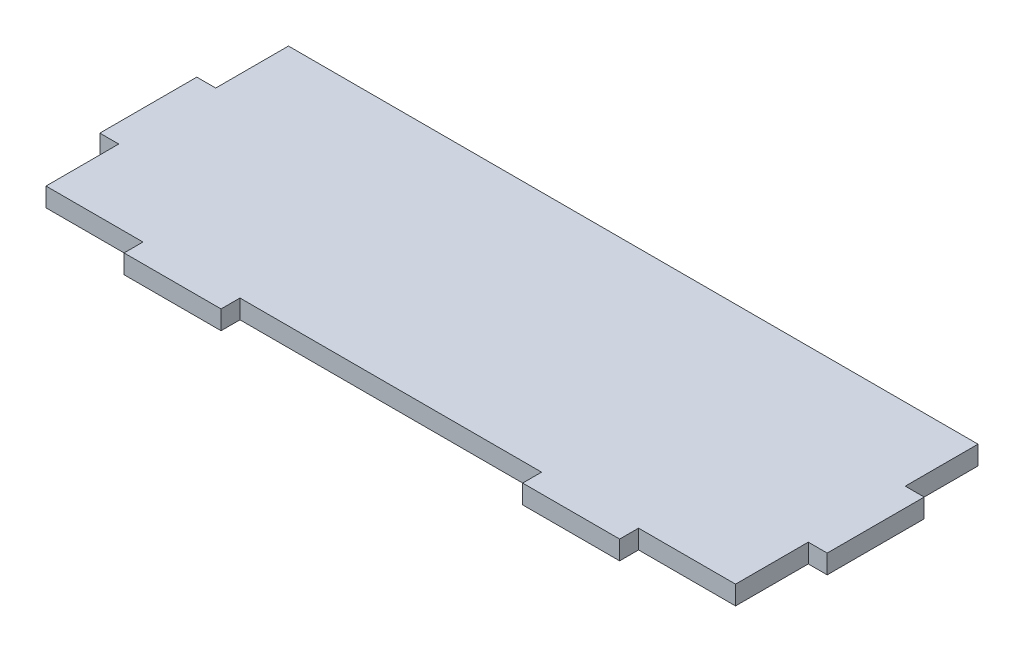
ISO-10303-21;
HEADER;
FILE_DESCRIPTION(('STEP AP214'),'2;1');
FILE_NAME('part.step','',(''),(''),'','','');
FILE_SCHEMA(('AUTOMOTIVE_DESIGN { 1 0 10303 214 1 1 1 1 }'));
ENDSEC;
DATA;
#1=APPLICATION_CONTEXT('core data for automotive mechanical design processes');
#2=APPLICATION_PROTOCOL_DEFINITION('international standard','automotive_design',2000,#1);
#3=PRODUCT_CONTEXT('',#1,'mechanical');
#4=PRODUCT('Part','Part','',(#3));
#5=PRODUCT_RELATED_PRODUCT_CATEGORY('part','',(#4));
#6=PRODUCT_DEFINITION_FORMATION('','',#4);
#7=PRODUCT_DEFINITION_CONTEXT('part definition',#1,'design');
#8=PRODUCT_DEFINITION('design','',#6,#7);
#9=PRODUCT_DEFINITION_SHAPE('','',#8);
#10=(LENGTH_UNIT() NAMED_UNIT(*) SI_UNIT(.MILLI.,.METRE.));
#11=(NAMED_UNIT(*) PLANE_ANGLE_UNIT() SI_UNIT($,.RADIAN.));
#12=(NAMED_UNIT(*) SI_UNIT($,.STERADIAN.) SOLID_ANGLE_UNIT());
#13=UNCERTAINTY_MEASURE_WITH_UNIT(LENGTH_MEASURE(1.E-05),#10,'distance_accuracy_value','');
#14=(GEOMETRIC_REPRESENTATION_CONTEXT(3) GLOBAL_UNCERTAINTY_ASSIGNED_CONTEXT((#13)) GLOBAL_UNIT_ASSIGNED_CONTEXT((#10,
#11,#12)) REPRESENTATION_CONTEXT('',''));
#15=CARTESIAN_POINT('',(0.,0.,0.));
#16=DIRECTION('',(0.,0.,1.));
#17=DIRECTION('',(1.,0.,0.));
#18=AXIS2_PLACEMENT_3D('',#15,#16,#17);
#19=CARTESIAN_POINT('',(51.1,3.9,25.));
#20=DIRECTION('',(0.,0.,-1.));
#21=DIRECTION('',(-1.,0.,0.));
#22=AXIS2_PLACEMENT_3D('',#19,#20,#21);
#23=PLANE('',#22);
#24=DIRECTION('',(1.,0.,0.));
#25=VECTOR('',#24,1.);
#26=CARTESIAN_POINT('',(51.1,0.,25.));
#27=LINE('',#26,#25);
#28=CARTESIAN_POINT('',(51.1,0.,25.));
#29=VERTEX_POINT('',#28);
#30=CARTESIAN_POINT('',(71.1,0.,25.));
#31=VERTEX_POINT('',#30);
#32=EDGE_CURVE('E214',#29,#31,#27,.T.);
#33=ORIENTED_EDGE('',*,*,#32,.T.);
#34=DIRECTION('',(0.,-1.,0.));
#35=VECTOR('',#34,1.);
#36=CARTESIAN_POINT('',(71.1,3.9,25.));
#37=LINE('',#36,#35);
#38=CARTESIAN_POINT('',(71.1,3.9,25.));
#39=VERTEX_POINT('',#38);
#40=EDGE_CURVE('E11',#39,#31,#37,.T.);
#41=ORIENTED_EDGE('',*,*,#40,.F.);
#42=DIRECTION('',(1.,0.,0.));
#43=VECTOR('',#42,1.);
#44=CARTESIAN_POINT('',(51.1,3.9,25.));
#45=LINE('',#44,#43);
#46=CARTESIAN_POINT('',(51.1,3.9,25.));
#47=VERTEX_POINT('',#46);
#48=EDGE_CURVE('E272',#47,#39,#45,.T.);
#49=ORIENTED_EDGE('',*,*,#48,.F.);
#50=DIRECTION('',(0.,-1.,0.));
#51=VECTOR('',#50,1.);
#52=CARTESIAN_POINT('',(51.1,3.9,25.));
#53=LINE('',#52,#51);
#54=EDGE_CURVE('E210',#47,#29,#53,.T.);
#55=ORIENTED_EDGE('',*,*,#54,.T.);
#56=EDGE_LOOP('',(#33,#41,#49,#55));
#57=FACE_BOUND('',#56,.T.);
#58=ADVANCED_FACE('F41',(#57),#23,.F.);
#59=CARTESIAN_POINT('',(71.1,3.9,9.99999999999999));
#60=DIRECTION('',(-1.,0.,0.));
#61=DIRECTION('',(0.,0.,1.));
#62=AXIS2_PLACEMENT_3D('',#59,#60,#61);
#63=PLANE('',#62);
#64=DIRECTION('',(0.,0.,-1.));
#65=VECTOR('',#64,1.);
#66=CARTESIAN_POINT('',(71.1,0.,9.99999999999999));
#67=LINE('',#66,#65);
#68=CARTESIAN_POINT('',(71.1,0.,9.99999999999999));
#69=VERTEX_POINT('',#68);
#70=EDGE_CURVE('E218',#31,#69,#67,.T.);
#71=ORIENTED_EDGE('',*,*,#70,.T.);
#72=DIRECTION('',(0.,-1.,0.));
#73=VECTOR('',#72,1.);
#74=CARTESIAN_POINT('',(71.1,3.9,9.99999999999999));
#75=LINE('',#74,#73);
#76=CARTESIAN_POINT('',(71.1,3.9,9.99999999999999));
#77=VERTEX_POINT('',#76);
#78=EDGE_CURVE('E50',#77,#69,#75,.T.);
#79=ORIENTED_EDGE('',*,*,#78,.F.);
#80=DIRECTION('',(0.,0.,-1.));
#81=VECTOR('',#80,1.);
#82=CARTESIAN_POINT('',(71.1,3.9,9.99999999999999));
#83=LINE('',#82,#81);
#84=EDGE_CURVE('E137',#39,#77,#83,.T.);
#85=ORIENTED_EDGE('',*,*,#84,.F.);
#86=ORIENTED_EDGE('',*,*,#40,.T.);
#87=EDGE_LOOP('',(#71,#79,#85,#86));
#88=FACE_BOUND('',#87,.T.);
#89=ADVANCED_FACE('F422',(#88),#63,.F.);
#90=CARTESIAN_POINT('',(75.,3.9,10.));
#91=DIRECTION('',(0.,0.,-1.));
#92=DIRECTION('',(-1.,0.,0.));
#93=AXIS2_PLACEMENT_3D('',#90,#91,#92);
#94=PLANE('',#93);
#95=DIRECTION('',(1.,0.,0.));
#96=VECTOR('',#95,1.);
#97=CARTESIAN_POINT('',(75.,0.,10.));
#98=LINE('',#97,#96);
#99=CARTESIAN_POINT('',(75.,0.,10.));
#100=VERTEX_POINT('',#99);
#101=EDGE_CURVE('E221',#69,#100,#98,.T.);
#102=ORIENTED_EDGE('',*,*,#101,.T.);
#103=DIRECTION('',(0.,-1.,0.));
#104=VECTOR('',#103,1.);
#105=CARTESIAN_POINT('',(75.,3.9,10.));
#106=LINE('',#105,#104);
#107=CARTESIAN_POINT('',(75.,3.9,10.));
#108=VERTEX_POINT('',#107);
#109=EDGE_CURVE('E331',#108,#100,#106,.T.);
#110=ORIENTED_EDGE('',*,*,#109,.F.);
#111=DIRECTION('',(1.,0.,0.));
#112=VECTOR('',#111,1.);
#113=CARTESIAN_POINT('',(75.,3.9,10.));
#114=LINE('',#113,#112);
#115=EDGE_CURVE('E341',#77,#108,#114,.T.);
#116=ORIENTED_EDGE('',*,*,#115,.F.);
#117=ORIENTED_EDGE('',*,*,#78,.T.);
#118=EDGE_LOOP('',(#102,#110,#116,#117));
#119=FACE_BOUND('',#118,.T.);
#120=ADVANCED_FACE('F339',(#119),#94,.F.);
#121=CARTESIAN_POINT('',(75.,3.9,-10.));
#122=DIRECTION('',(-1.,0.,0.));
#123=DIRECTION('',(0.,0.,1.));
#124=AXIS2_PLACEMENT_3D('',#121,#122,#123);
#125=PLANE('',#124);
#126=DIRECTION('',(0.,0.,-1.));
#127=VECTOR('',#126,1.);
#128=CARTESIAN_POINT('',(75.,0.,-10.));
#129=LINE('',#128,#127);
#130=CARTESIAN_POINT('',(75.,0.,-10.));
#131=VERTEX_POINT('',#130);
#132=EDGE_CURVE('E224',#100,#131,#129,.T.);
#133=ORIENTED_EDGE('',*,*,#132,.T.);
#134=DIRECTION('',(0.,-1.,0.));
#135=VECTOR('',#134,1.);
#136=CARTESIAN_POINT('',(75.,3.9,-10.));
#137=LINE('',#136,#135);
#138=CARTESIAN_POINT('',(75.,3.9,-10.));
#139=VERTEX_POINT('',#138);
#140=EDGE_CURVE('E327',#139,#131,#137,.T.);
#141=ORIENTED_EDGE('',*,*,#140,.F.);
#142=DIRECTION('',(0.,0.,-1.));
#143=VECTOR('',#142,1.);
#144=CARTESIAN_POINT('',(75.,3.9,-10.));
#145=LINE('',#144,#143);
#146=EDGE_CURVE('E360',#108,#139,#145,.T.);
#147=ORIENTED_EDGE('',*,*,#146,.F.);
#148=ORIENTED_EDGE('',*,*,#109,.T.);
#149=EDGE_LOOP('',(#133,#141,#147,#148));
#150=FACE_BOUND('',#149,.T.);
#151=ADVANCED_FACE('F350',(#150),#125,.F.);
#152=CARTESIAN_POINT('',(71.1,3.9,-9.99999999999999));
#153=DIRECTION('',(0.,0.,1.));
#154=DIRECTION('',(1.,0.,0.));
#155=AXIS2_PLACEMENT_3D('',#152,#153,#154);
#156=PLANE('',#155);
#157=DIRECTION('',(-1.,0.,0.));
#158=VECTOR('',#157,1.);
#159=CARTESIAN_POINT('',(71.1,0.,-9.99999999999999));
#160=LINE('',#159,#158);
#161=CARTESIAN_POINT('',(71.1,0.,-9.99999999999999));
#162=VERTEX_POINT('',#161);
#163=EDGE_CURVE('E227',#131,#162,#160,.T.);
#164=ORIENTED_EDGE('',*,*,#163,.T.);
#165=DIRECTION('',(0.,-1.,0.));
#166=VECTOR('',#165,1.);
#167=CARTESIAN_POINT('',(71.1,3.9,-9.99999999999999));
#168=LINE('',#167,#166);
#169=CARTESIAN_POINT('',(71.1,3.9,-9.99999999999999));
#170=VERTEX_POINT('',#169);
#171=EDGE_CURVE('E323',#170,#162,#168,.T.);
#172=ORIENTED_EDGE('',*,*,#171,.F.);
#173=DIRECTION('',(-1.,0.,0.));
#174=VECTOR('',#173,1.);
#175=CARTESIAN_POINT('',(71.1,3.9,-9.99999999999999));
#176=LINE('',#175,#174);
#177=EDGE_CURVE('E356',#139,#170,#176,.T.);
#178=ORIENTED_EDGE('',*,*,#177,.F.);
#179=ORIENTED_EDGE('',*,*,#140,.T.);
#180=EDGE_LOOP('',(#164,#172,#178,#179));
#181=FACE_BOUND('',#180,.T.);
#182=ADVANCED_FACE('F354',(#181),#156,.F.);
#183=CARTESIAN_POINT('',(71.1,3.9,-25.));
#184=DIRECTION('',(-1.,0.,0.));
#185=DIRECTION('',(0.,0.,1.));
#186=AXIS2_PLACEMENT_3D('',#183,#184,#185);
#187=PLANE('',#186);
#188=DIRECTION('',(0.,0.,-1.));
#189=VECTOR('',#188,1.);
#190=CARTESIAN_POINT('',(71.1,0.,-25.));
#191=LINE('',#190,#189);
#192=CARTESIAN_POINT('',(71.1,0.,-25.));
#193=VERTEX_POINT('',#192);
#194=EDGE_CURVE('E230',#162,#193,#191,.T.);
#195=ORIENTED_EDGE('',*,*,#194,.T.);
#196=DIRECTION('',(0.,-1.,0.));
#197=VECTOR('',#196,1.);
#198=CARTESIAN_POINT('',(71.1,3.9,-25.));
#199=LINE('',#198,#197);
#200=CARTESIAN_POINT('',(71.1,3.9,-25.));
#201=VERTEX_POINT('',#200);
#202=EDGE_CURVE('E319',#201,#193,#199,.T.);
#203=ORIENTED_EDGE('',*,*,#202,.F.);
#204=DIRECTION('',(0.,0.,-1.));
#205=VECTOR('',#204,1.);
#206=CARTESIAN_POINT('',(71.1,3.9,-25.));
#207=LINE('',#206,#205);
#208=EDGE_CURVE('E359',#170,#201,#207,.T.);
#209=ORIENTED_EDGE('',*,*,#208,.F.);
#210=ORIENTED_EDGE('',*,*,#171,.T.);
#211=EDGE_LOOP('',(#195,#203,#209,#210));
#212=FACE_BOUND('',#211,.T.);
#213=ADVANCED_FACE('F435',(#212),#187,.F.);
#214=CARTESIAN_POINT('',(-71.1,3.9,-25.));
#215=DIRECTION('',(0.,0.,1.));
#216=DIRECTION('',(1.,0.,0.));
#217=AXIS2_PLACEMENT_3D('',#214,#215,#216);
#218=PLANE('',#217);
#219=DIRECTION('',(-1.,0.,0.));
#220=VECTOR('',#219,1.);
#221=CARTESIAN_POINT('',(-71.1,0.,-25.));
#222=LINE('',#221,#220);
#223=CARTESIAN_POINT('',(-71.1,0.,-25.));
#224=VERTEX_POINT('',#223);
#225=EDGE_CURVE('E233',#193,#224,#222,.T.);
#226=ORIENTED_EDGE('',*,*,#225,.T.);
#227=DIRECTION('',(0.,-1.,0.));
#228=VECTOR('',#227,1.);
#229=CARTESIAN_POINT('',(-71.1,3.9,-25.));
#230=LINE('',#229,#228);
#231=CARTESIAN_POINT('',(-71.1,3.9,-25.));
#232=VERTEX_POINT('',#231);
#233=EDGE_CURVE('E315',#232,#224,#230,.T.);
#234=ORIENTED_EDGE('',*,*,#233,.F.);
#235=DIRECTION('',(-1.,0.,0.));
#236=VECTOR('',#235,1.);
#237=CARTESIAN_POINT('',(-71.1,3.9,-25.));
#238=LINE('',#237,#236);
#239=EDGE_CURVE('E364',#201,#232,#238,.T.);
#240=ORIENTED_EDGE('',*,*,#239,.F.);
#241=ORIENTED_EDGE('',*,*,#202,.T.);
#242=EDGE_LOOP('',(#226,#234,#240,#241));
#243=FACE_BOUND('',#242,.T.);
#244=ADVANCED_FACE('F438',(#243),#218,.F.);
#245=CARTESIAN_POINT('',(-71.1,3.9,-25.));
#246=DIRECTION('',(1.,0.,0.));
#247=DIRECTION('',(0.,0.,-1.));
#248=AXIS2_PLACEMENT_3D('',#245,#246,#247);
#249=PLANE('',#248);
#250=DIRECTION('',(0.,0.,1.));
#251=VECTOR('',#250,1.);
#252=CARTESIAN_POINT('',(-71.1,0.,-25.));
#253=LINE('',#252,#251);
#254=CARTESIAN_POINT('',(-71.1,0.,-10.));
#255=VERTEX_POINT('',#254);
#256=EDGE_CURVE('E236',#224,#255,#253,.T.);
#257=ORIENTED_EDGE('',*,*,#256,.T.);
#258=DIRECTION('',(0.,-1.,0.));
#259=VECTOR('',#258,1.);
#260=CARTESIAN_POINT('',(-71.1,3.9,-10.));
#261=LINE('',#260,#259);
#262=CARTESIAN_POINT('',(-71.1,3.9,-10.));
#263=VERTEX_POINT('',#262);
#264=EDGE_CURVE('E311',#263,#255,#261,.T.);
#265=ORIENTED_EDGE('',*,*,#264,.F.);
#266=DIRECTION('',(0.,0.,1.));
#267=VECTOR('',#266,1.);
#268=CARTESIAN_POINT('',(-71.1,3.9,-25.));
#269=LINE('',#268,#267);
#270=EDGE_CURVE('E371',#232,#263,#269,.T.);
#271=ORIENTED_EDGE('',*,*,#270,.F.);
#272=ORIENTED_EDGE('',*,*,#233,.T.);
#273=EDGE_LOOP('',(#257,#265,#271,#272));
#274=FACE_BOUND('',#273,.T.);
#275=ADVANCED_FACE('F442',(#274),#249,.F.);
#276=CARTESIAN_POINT('',(-71.1,3.9,-10.));
#277=DIRECTION('',(0.,0.,1.));
#278=DIRECTION('',(1.,0.,0.));
#279=AXIS2_PLACEMENT_3D('',#276,#277,#278);
#280=PLANE('',#279);
#281=DIRECTION('',(-1.,0.,0.));
#282=VECTOR('',#281,1.);
#283=CARTESIAN_POINT('',(-71.1,0.,-10.));
#284=LINE('',#283,#282);
#285=CARTESIAN_POINT('',(-75.,0.,-10.));
#286=VERTEX_POINT('',#285);
#287=EDGE_CURVE('E239',#255,#286,#284,.T.);
#288=ORIENTED_EDGE('',*,*,#287,.T.);
#289=DIRECTION('',(0.,-1.,0.));
#290=VECTOR('',#289,1.);
#291=CARTESIAN_POINT('',(-75.,3.9,-10.));
#292=LINE('',#291,#290);
#293=CARTESIAN_POINT('',(-75.,3.9,-10.));
#294=VERTEX_POINT('',#293);
#295=EDGE_CURVE('E307',#294,#286,#292,.T.);
#296=ORIENTED_EDGE('',*,*,#295,.F.);
#297=DIRECTION('',(-1.,0.,0.));
#298=VECTOR('',#297,1.);
#299=CARTESIAN_POINT('',(-71.1,3.9,-10.));
#300=LINE('',#299,#298);
#301=EDGE_CURVE('E374',#263,#294,#300,.T.);
#302=ORIENTED_EDGE('',*,*,#301,.F.);
#303=ORIENTED_EDGE('',*,*,#264,.T.);
#304=EDGE_LOOP('',(#288,#296,#302,#303));
#305=FACE_BOUND('',#304,.T.);
#306=ADVANCED_FACE('F446',(#305),#280,.F.);
#307=CARTESIAN_POINT('',(-75.,3.9,-10.));
#308=DIRECTION('',(1.,0.,0.));
#309=DIRECTION('',(0.,0.,-1.));
#310=AXIS2_PLACEMENT_3D('',#307,#308,#309);
#311=PLANE('',#310);
#312=DIRECTION('',(0.,0.,1.));
#313=VECTOR('',#312,1.);
#314=CARTESIAN_POINT('',(-75.,0.,-10.));
#315=LINE('',#314,#313);
#316=CARTESIAN_POINT('',(-75.,0.,9.99999999999999));
#317=VERTEX_POINT('',#316);
#318=EDGE_CURVE('E242',#286,#317,#315,.T.);
#319=ORIENTED_EDGE('',*,*,#318,.T.);
#320=DIRECTION('',(0.,-1.,0.));
#321=VECTOR('',#320,1.);
#322=CARTESIAN_POINT('',(-75.,3.9,9.99999999999999));
#323=LINE('',#322,#321);
#324=CARTESIAN_POINT('',(-75.,3.9,9.99999999999999));
#325=VERTEX_POINT('',#324);
#326=EDGE_CURVE('E303',#325,#317,#323,.T.);
#327=ORIENTED_EDGE('',*,*,#326,.F.);
#328=DIRECTION('',(0.,0.,1.));
#329=VECTOR('',#328,1.);
#330=CARTESIAN_POINT('',(-75.,3.9,-10.));
#331=LINE('',#330,#329);
#332=EDGE_CURVE('E377',#294,#325,#331,.T.);
#333=ORIENTED_EDGE('',*,*,#332,.F.);
#334=ORIENTED_EDGE('',*,*,#295,.T.);
#335=EDGE_LOOP('',(#319,#327,#333,#334));
#336=FACE_BOUND('',#335,.T.);
#337=ADVANCED_FACE('F450',(#336),#311,.F.);
#338=CARTESIAN_POINT('',(-75.,3.9,9.99999999999999));
#339=DIRECTION('',(0.,0.,-1.));
#340=DIRECTION('',(-1.,0.,0.));
#341=AXIS2_PLACEMENT_3D('',#338,#339,#340);
#342=PLANE('',#341);
#343=DIRECTION('',(1.,0.,0.));
#344=VECTOR('',#343,1.);
#345=CARTESIAN_POINT('',(-75.,0.,9.99999999999999));
#346=LINE('',#345,#344);
#347=CARTESIAN_POINT('',(-71.1,0.,9.99999999999999));
#348=VERTEX_POINT('',#347);
#349=EDGE_CURVE('E245',#317,#348,#346,.T.);
#350=ORIENTED_EDGE('',*,*,#349,.T.);
#351=DIRECTION('',(0.,-1.,0.));
#352=VECTOR('',#351,1.);
#353=CARTESIAN_POINT('',(-71.1,3.9,9.99999999999999));
#354=LINE('',#353,#352);
#355=CARTESIAN_POINT('',(-71.1,3.9,9.99999999999999));
#356=VERTEX_POINT('',#355);
#357=EDGE_CURVE('E299',#356,#348,#354,.T.);
#358=ORIENTED_EDGE('',*,*,#357,.F.);
#359=DIRECTION('',(1.,0.,0.));
#360=VECTOR('',#359,1.);
#361=CARTESIAN_POINT('',(-75.,3.9,9.99999999999999));
#362=LINE('',#361,#360);
#363=EDGE_CURVE('E380',#325,#356,#362,.T.);
#364=ORIENTED_EDGE('',*,*,#363,.F.);
#365=ORIENTED_EDGE('',*,*,#326,.T.);
#366=EDGE_LOOP('',(#350,#358,#364,#365));
#367=FACE_BOUND('',#366,.T.);
#368=ADVANCED_FACE('F454',(#367),#342,.F.);
#369=CARTESIAN_POINT('',(-71.1,3.9,9.99999999999999));
#370=DIRECTION('',(1.,0.,0.));
#371=DIRECTION('',(0.,0.,-1.));
#372=AXIS2_PLACEMENT_3D('',#369,#370,#371);
#373=PLANE('',#372);
#374=DIRECTION('',(0.,0.,1.));
#375=VECTOR('',#374,1.);
#376=CARTESIAN_POINT('',(-71.1,0.,9.99999999999999));
#377=LINE('',#376,#375);
#378=CARTESIAN_POINT('',(-71.1,0.,25.));
#379=VERTEX_POINT('',#378);
#380=EDGE_CURVE('E248',#348,#379,#377,.T.);
#381=ORIENTED_EDGE('',*,*,#380,.T.);
#382=DIRECTION('',(0.,-1.,0.));
#383=VECTOR('',#382,1.);
#384=CARTESIAN_POINT('',(-71.1,3.9,25.));
#385=LINE('',#384,#383);
#386=CARTESIAN_POINT('',(-71.1,3.9,25.));
#387=VERTEX_POINT('',#386);
#388=EDGE_CURVE('E295',#387,#379,#385,.T.);
#389=ORIENTED_EDGE('',*,*,#388,.F.);
#390=DIRECTION('',(0.,0.,1.));
#391=VECTOR('',#390,1.);
#392=CARTESIAN_POINT('',(-71.1,3.9,9.99999999999999));
#393=LINE('',#392,#391);
#394=EDGE_CURVE('E383',#356,#387,#393,.T.);
#395=ORIENTED_EDGE('',*,*,#394,.F.);
#396=ORIENTED_EDGE('',*,*,#357,.T.);
#397=EDGE_LOOP('',(#381,#389,#395,#396));
#398=FACE_BOUND('',#397,.T.);
#399=ADVANCED_FACE('F458',(#398),#373,.F.);
#400=CARTESIAN_POINT('',(-71.1,3.9,25.));
#401=DIRECTION('',(0.,0.,-1.));
#402=DIRECTION('',(-1.,0.,0.));
#403=AXIS2_PLACEMENT_3D('',#400,#401,#402);
#404=PLANE('',#403);
#405=DIRECTION('',(1.,0.,0.));
#406=VECTOR('',#405,1.);
#407=CARTESIAN_POINT('',(-71.1,0.,25.));
#408=LINE('',#407,#406);
#409=CARTESIAN_POINT('',(-51.1,0.,25.));
#410=VERTEX_POINT('',#409);
#411=EDGE_CURVE('E251',#379,#410,#408,.T.);
#412=ORIENTED_EDGE('',*,*,#411,.T.);
#413=DIRECTION('',(0.,-1.,0.));
#414=VECTOR('',#413,1.);
#415=CARTESIAN_POINT('',(-51.1,3.9,25.));
#416=LINE('',#415,#414);
#417=CARTESIAN_POINT('',(-51.1,3.9,25.));
#418=VERTEX_POINT('',#417);
#419=EDGE_CURVE('E291',#418,#410,#416,.T.);
#420=ORIENTED_EDGE('',*,*,#419,.F.);
#421=DIRECTION('',(1.,0.,0.));
#422=VECTOR('',#421,1.);
#423=CARTESIAN_POINT('',(-71.1,3.9,25.));
#424=LINE('',#423,#422);
#425=EDGE_CURVE('E386',#387,#418,#424,.T.);
#426=ORIENTED_EDGE('',*,*,#425,.F.);
#427=ORIENTED_EDGE('',*,*,#388,.T.);
#428=EDGE_LOOP('',(#412,#420,#426,#427));
#429=FACE_BOUND('',#428,.T.);
#430=ADVANCED_FACE('F462',(#429),#404,.F.);
#431=CARTESIAN_POINT('',(-51.1,3.9,25.));
#432=DIRECTION('',(1.,0.,0.));
#433=DIRECTION('',(0.,0.,-1.));
#434=AXIS2_PLACEMENT_3D('',#431,#432,#433);
#435=PLANE('',#434);
#436=DIRECTION('',(0.,0.,1.));
#437=VECTOR('',#436,1.);
#438=CARTESIAN_POINT('',(-51.1,0.,25.));
#439=LINE('',#438,#437);
#440=CARTESIAN_POINT('',(-51.1,0.,28.9));
#441=VERTEX_POINT('',#440);
#442=EDGE_CURVE('E254',#410,#441,#439,.T.);
#443=ORIENTED_EDGE('',*,*,#442,.T.);
#444=DIRECTION('',(0.,-1.,0.));
#445=VECTOR('',#444,1.);
#446=CARTESIAN_POINT('',(-51.1,3.9,28.9));
#447=LINE('',#446,#445);
#448=CARTESIAN_POINT('',(-51.1,3.9,28.9));
#449=VERTEX_POINT('',#448);
#450=EDGE_CURVE('E287',#449,#441,#447,.T.);
#451=ORIENTED_EDGE('',*,*,#450,.F.);
#452=DIRECTION('',(0.,0.,1.));
#453=VECTOR('',#452,1.);
#454=CARTESIAN_POINT('',(-51.1,3.9,25.));
#455=LINE('',#454,#453);
#456=EDGE_CURVE('E389',#418,#449,#455,.T.);
#457=ORIENTED_EDGE('',*,*,#456,.F.);
#458=ORIENTED_EDGE('',*,*,#419,.T.);
#459=EDGE_LOOP('',(#443,#451,#457,#458));
#460=FACE_BOUND('',#459,.T.);
#461=ADVANCED_FACE('F466',(#460),#435,.F.);
#462=CARTESIAN_POINT('',(-51.1,3.9,28.9));
#463=DIRECTION('',(0.,0.,-1.));
#464=DIRECTION('',(-1.,0.,0.));
#465=AXIS2_PLACEMENT_3D('',#462,#463,#464);
#466=PLANE('',#465);
#467=DIRECTION('',(1.,0.,0.));
#468=VECTOR('',#467,1.);
#469=CARTESIAN_POINT('',(-51.1,0.,28.9));
#470=LINE('',#469,#468);
#471=CARTESIAN_POINT('',(-31.1,0.,28.9));
#472=VERTEX_POINT('',#471);
#473=EDGE_CURVE('E257',#441,#472,#470,.T.);
#474=ORIENTED_EDGE('',*,*,#473,.T.);
#475=DIRECTION('',(0.,-1.,0.));
#476=VECTOR('',#475,1.);
#477=CARTESIAN_POINT('',(-31.1,3.9,28.9));
#478=LINE('',#477,#476);
#479=CARTESIAN_POINT('',(-31.1,3.9,28.9));
#480=VERTEX_POINT('',#479);
#481=EDGE_CURVE('E283',#480,#472,#478,.T.);
#482=ORIENTED_EDGE('',*,*,#481,.F.);
#483=DIRECTION('',(1.,0.,0.));
#484=VECTOR('',#483,1.);
#485=CARTESIAN_POINT('',(-51.1,3.9,28.9));
#486=LINE('',#485,#484);
#487=EDGE_CURVE('E392',#449,#480,#486,.T.);
#488=ORIENTED_EDGE('',*,*,#487,.F.);
#489=ORIENTED_EDGE('',*,*,#450,.T.);
#490=EDGE_LOOP('',(#474,#482,#488,#489));
#491=FACE_BOUND('',#490,.T.);
#492=ADVANCED_FACE('F470',(#491),#466,.F.);
#493=CARTESIAN_POINT('',(-31.1,3.9,28.9));
#494=DIRECTION('',(-1.,0.,0.));
#495=DIRECTION('',(0.,0.,1.));
#496=AXIS2_PLACEMENT_3D('',#493,#494,#495);
#497=PLANE('',#496);
#498=DIRECTION('',(0.,0.,-1.));
#499=VECTOR('',#498,1.);
#500=CARTESIAN_POINT('',(-31.1,0.,28.9));
#501=LINE('',#500,#499);
#502=CARTESIAN_POINT('',(-31.1,0.,25.));
#503=VERTEX_POINT('',#502);
#504=EDGE_CURVE('E260',#472,#503,#501,.T.);
#505=ORIENTED_EDGE('',*,*,#504,.T.);
#506=DIRECTION('',(0.,-1.,0.));
#507=VECTOR('',#506,1.);
#508=CARTESIAN_POINT('',(-31.1,3.9,25.));
#509=LINE('',#508,#507);
#510=CARTESIAN_POINT('',(-31.1,3.9,25.));
#511=VERTEX_POINT('',#510);
#512=EDGE_CURVE('E279',#511,#503,#509,.T.);
#513=ORIENTED_EDGE('',*,*,#512,.F.);
#514=DIRECTION('',(0.,0.,-1.));
#515=VECTOR('',#514,1.);
#516=CARTESIAN_POINT('',(-31.1,3.9,28.9));
#517=LINE('',#516,#515);
#518=EDGE_CURVE('E395',#480,#511,#517,.T.);
#519=ORIENTED_EDGE('',*,*,#518,.F.);
#520=ORIENTED_EDGE('',*,*,#481,.T.);
#521=EDGE_LOOP('',(#505,#513,#519,#520));
#522=FACE_BOUND('',#521,.T.);
#523=ADVANCED_FACE('F403',(#522),#497,.F.);
#524=CARTESIAN_POINT('',(-31.1,3.9,25.));
#525=DIRECTION('',(0.,0.,-1.));
#526=DIRECTION('',(-1.,0.,0.));
#527=AXIS2_PLACEMENT_3D('',#524,#525,#526);
#528=PLANE('',#527);
#529=DIRECTION('',(1.,0.,0.));
#530=VECTOR('',#529,1.);
#531=CARTESIAN_POINT('',(-31.1,0.,25.));
#532=LINE('',#531,#530);
#533=CARTESIAN_POINT('',(31.1,0.,25.));
#534=VERTEX_POINT('',#533);
#535=EDGE_CURVE('E263',#503,#534,#532,.T.);
#536=ORIENTED_EDGE('',*,*,#535,.T.);
#537=DIRECTION('',(0.,-1.,0.));
#538=VECTOR('',#537,1.);
#539=CARTESIAN_POINT('',(31.1,3.9,25.));
#540=LINE('',#539,#538);
#541=CARTESIAN_POINT('',(31.1,3.9,25.));
#542=VERTEX_POINT('',#541);
#543=EDGE_CURVE('E203',#542,#534,#540,.T.);
#544=ORIENTED_EDGE('',*,*,#543,.F.);
#545=DIRECTION('',(1.,0.,0.));
#546=VECTOR('',#545,1.);
#547=CARTESIAN_POINT('',(-31.1,3.9,25.));
#548=LINE('',#547,#546);
#549=EDGE_CURVE('E192',#511,#542,#548,.T.);
#550=ORIENTED_EDGE('',*,*,#549,.F.);
#551=ORIENTED_EDGE('',*,*,#512,.T.);
#552=EDGE_LOOP('',(#536,#544,#550,#551));
#553=FACE_BOUND('',#552,.T.);
#554=ADVANCED_FACE('F407',(#553),#528,.F.);
#555=CARTESIAN_POINT('',(31.1,3.9,25.));
#556=DIRECTION('',(1.,0.,0.));
#557=DIRECTION('',(0.,0.,-1.));
#558=AXIS2_PLACEMENT_3D('',#555,#556,#557);
#559=PLANE('',#558);
#560=DIRECTION('',(0.,0.,1.));
#561=VECTOR('',#560,1.);
#562=CARTESIAN_POINT('',(31.1,0.,25.));
#563=LINE('',#562,#561);
#564=CARTESIAN_POINT('',(31.1,0.,28.9));
#565=VERTEX_POINT('',#564);
#566=EDGE_CURVE('E201',#534,#565,#563,.T.);
#567=ORIENTED_EDGE('',*,*,#566,.T.);
#568=DIRECTION('',(0.,-1.,0.));
#569=VECTOR('',#568,1.);
#570=CARTESIAN_POINT('',(31.1,3.9,28.9));
#571=LINE('',#570,#569);
#572=CARTESIAN_POINT('',(31.1,3.9,28.9));
#573=VERTEX_POINT('',#572);
#574=EDGE_CURVE('E198',#573,#565,#571,.T.);
#575=ORIENTED_EDGE('',*,*,#574,.F.);
#576=DIRECTION('',(0.,0.,1.));
#577=VECTOR('',#576,1.);
#578=CARTESIAN_POINT('',(31.1,3.9,25.));
#579=LINE('',#578,#577);
#580=EDGE_CURVE('E186',#542,#573,#579,.T.);
#581=ORIENTED_EDGE('',*,*,#580,.F.);
#582=ORIENTED_EDGE('',*,*,#543,.T.);
#583=EDGE_LOOP('',(#567,#575,#581,#582));
#584=FACE_BOUND('',#583,.T.);
#585=ADVANCED_FACE('F199',(#584),#559,.F.);
#586=CARTESIAN_POINT('',(31.1,3.9,28.9));
#587=DIRECTION('',(0.,0.,-1.));
#588=DIRECTION('',(-1.,0.,0.));
#589=AXIS2_PLACEMENT_3D('',#586,#587,#588);
#590=PLANE('',#589);
#591=DIRECTION('',(1.,0.,0.));
#592=VECTOR('',#591,1.);
#593=CARTESIAN_POINT('',(31.1,0.,28.9));
#594=LINE('',#593,#592);
#595=CARTESIAN_POINT('',(51.1,0.,28.9));
#596=VERTEX_POINT('',#595);
#597=EDGE_CURVE('E123',#565,#596,#594,.T.);
#598=ORIENTED_EDGE('',*,*,#597,.T.);
#599=DIRECTION('',(0.,-1.,0.));
#600=VECTOR('',#599,1.);
#601=CARTESIAN_POINT('',(51.1,3.9,28.9));
#602=LINE('',#601,#600);
#603=CARTESIAN_POINT('',(51.1,3.9,28.9));
#604=VERTEX_POINT('',#603);
#605=EDGE_CURVE('E204',#604,#596,#602,.T.);
#606=ORIENTED_EDGE('',*,*,#605,.F.);
#607=DIRECTION('',(1.,0.,0.));
#608=VECTOR('',#607,1.);
#609=CARTESIAN_POINT('',(31.1,3.9,28.9));
#610=LINE('',#609,#608);
#611=EDGE_CURVE('E190',#573,#604,#610,.T.);
#612=ORIENTED_EDGE('',*,*,#611,.F.);
#613=ORIENTED_EDGE('',*,*,#574,.T.);
#614=EDGE_LOOP('',(#598,#606,#612,#613));
#615=FACE_BOUND('',#614,.T.);
#616=ADVANCED_FACE('F206',(#615),#590,.F.);
#617=CARTESIAN_POINT('',(51.1,3.9,28.9));
#618=DIRECTION('',(-1.,0.,0.));
#619=DIRECTION('',(0.,0.,1.));
#620=AXIS2_PLACEMENT_3D('',#617,#618,#619);
#621=PLANE('',#620);
#622=DIRECTION('',(0.,0.,-1.));
#623=VECTOR('',#622,1.);
#624=CARTESIAN_POINT('',(51.1,0.,28.9));
#625=LINE('',#624,#623);
#626=EDGE_CURVE('E129',#596,#29,#625,.T.);
#627=ORIENTED_EDGE('',*,*,#626,.T.);
#628=ORIENTED_EDGE('',*,*,#54,.F.);
#629=DIRECTION('',(0.,0.,-1.));
#630=VECTOR('',#629,1.);
#631=CARTESIAN_POINT('',(51.1,3.9,28.9));
#632=LINE('',#631,#630);
#633=EDGE_CURVE('E58',#604,#47,#632,.T.);
#634=ORIENTED_EDGE('',*,*,#633,.F.);
#635=ORIENTED_EDGE('',*,*,#605,.T.);
#636=EDGE_LOOP('',(#627,#628,#634,#635));
#637=FACE_BOUND('',#636,.T.);
#638=ADVANCED_FACE('F411',(#637),#621,.F.);
#639=CARTESIAN_POINT('',(0.,3.9,0.));
#640=DIRECTION('',(0.,-1.,0.));
#641=DIRECTION('',(0.,0.,-1.));
#642=AXIS2_PLACEMENT_3D('',#639,#640,#641);
#643=PLANE('',#642);
#644=ORIENTED_EDGE('',*,*,#48,.T.);
#645=ORIENTED_EDGE('',*,*,#84,.T.);
#646=ORIENTED_EDGE('',*,*,#115,.T.);
#647=ORIENTED_EDGE('',*,*,#146,.T.);
#648=ORIENTED_EDGE('',*,*,#177,.T.);
#649=ORIENTED_EDGE('',*,*,#208,.T.);
#650=ORIENTED_EDGE('',*,*,#239,.T.);
#651=ORIENTED_EDGE('',*,*,#270,.T.);
#652=ORIENTED_EDGE('',*,*,#301,.T.);
#653=ORIENTED_EDGE('',*,*,#332,.T.);
#654=ORIENTED_EDGE('',*,*,#363,.T.);
#655=ORIENTED_EDGE('',*,*,#394,.T.);
#656=ORIENTED_EDGE('',*,*,#425,.T.);
#657=ORIENTED_EDGE('',*,*,#456,.T.);
#658=ORIENTED_EDGE('',*,*,#487,.T.);
#659=ORIENTED_EDGE('',*,*,#518,.T.);
#660=ORIENTED_EDGE('',*,*,#549,.T.);
#661=ORIENTED_EDGE('',*,*,#580,.T.);
#662=ORIENTED_EDGE('',*,*,#611,.T.);
#663=ORIENTED_EDGE('',*,*,#633,.T.);
#664=EDGE_LOOP('',(#644,#645,#646,#647,#648,#649,#650,#651,#652,#653,#654,#655,#656,#657,#658,
#659,#660,#661,#662,#663));
#665=FACE_BOUND('',#664,.T.);
#666=ADVANCED_FACE('F188',(#665),#643,.F.);
#667=CARTESIAN_POINT('',(0.,0.,0.));
#668=DIRECTION('',(0.,-1.,0.));
#669=DIRECTION('',(0.,0.,-1.));
#670=AXIS2_PLACEMENT_3D('',#667,#668,#669);
#671=PLANE('',#670);
#672=ORIENTED_EDGE('',*,*,#32,.F.);
#673=ORIENTED_EDGE('',*,*,#626,.F.);
#674=ORIENTED_EDGE('',*,*,#597,.F.);
#675=ORIENTED_EDGE('',*,*,#566,.F.);
#676=ORIENTED_EDGE('',*,*,#535,.F.);
#677=ORIENTED_EDGE('',*,*,#504,.F.);
#678=ORIENTED_EDGE('',*,*,#473,.F.);
#679=ORIENTED_EDGE('',*,*,#442,.F.);
#680=ORIENTED_EDGE('',*,*,#411,.F.);
#681=ORIENTED_EDGE('',*,*,#380,.F.);
#682=ORIENTED_EDGE('',*,*,#349,.F.);
#683=ORIENTED_EDGE('',*,*,#318,.F.);
#684=ORIENTED_EDGE('',*,*,#287,.F.);
#685=ORIENTED_EDGE('',*,*,#256,.F.);
#686=ORIENTED_EDGE('',*,*,#225,.F.);
#687=ORIENTED_EDGE('',*,*,#194,.F.);
#688=ORIENTED_EDGE('',*,*,#163,.F.);
#689=ORIENTED_EDGE('',*,*,#132,.F.);
#690=ORIENTED_EDGE('',*,*,#101,.F.);
#691=ORIENTED_EDGE('',*,*,#70,.F.);
#692=EDGE_LOOP('',(#672,#673,#674,#675,#676,#677,#678,#679,#680,#681,#682,#683,#684,#685,#686,
#687,#688,#689,#690,#691));
#693=FACE_BOUND('',#692,.T.);
#694=ADVANCED_FACE('F345',(#693),#671,.T.);
#695=CLOSED_SHELL('',(#58,#89,#120,#151,#182,#213,#244,#275,#306,#337,#368,#399,#430,#461,#492,
#523,#554,#585,#616,#638,#666,#694));
#696=MANIFOLD_SOLID_BREP('B2',#695);
#697=ADVANCED_BREP_SHAPE_REPRESENTATION('',(#18,#696),#14);
#698=SHAPE_DEFINITION_REPRESENTATION(#9,#697);
ENDSEC;
END-ISO-10303-21;
